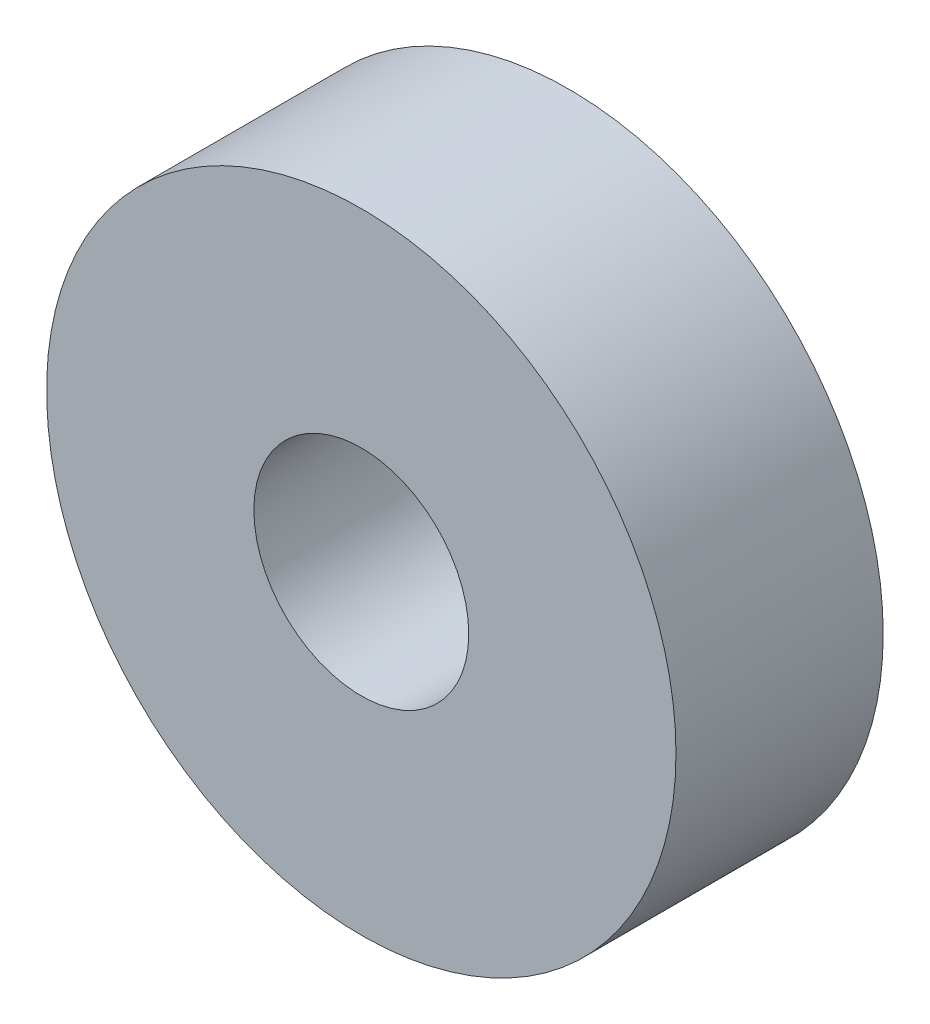
ISO-10303-21;
HEADER;
FILE_DESCRIPTION(('STEP AP214'),'2;1');
FILE_NAME('part.step','',(''),(''),'','','');
FILE_SCHEMA(('AUTOMOTIVE_DESIGN { 1 0 10303 214 1 1 1 1 }'));
ENDSEC;
DATA;
#1=APPLICATION_CONTEXT('core data for automotive mechanical design processes');
#2=APPLICATION_PROTOCOL_DEFINITION('international standard','automotive_design',2000,#1);
#3=PRODUCT_CONTEXT('',#1,'mechanical');
#4=PRODUCT('Part','Part','',(#3));
#5=PRODUCT_RELATED_PRODUCT_CATEGORY('part','',(#4));
#6=PRODUCT_DEFINITION_FORMATION('','',#4);
#7=PRODUCT_DEFINITION_CONTEXT('part definition',#1,'design');
#8=PRODUCT_DEFINITION('design','',#6,#7);
#9=PRODUCT_DEFINITION_SHAPE('','',#8);
#10=(LENGTH_UNIT() NAMED_UNIT(*) SI_UNIT(.MILLI.,.METRE.));
#11=(NAMED_UNIT(*) PLANE_ANGLE_UNIT() SI_UNIT($,.RADIAN.));
#12=(NAMED_UNIT(*) SI_UNIT($,.STERADIAN.) SOLID_ANGLE_UNIT());
#13=UNCERTAINTY_MEASURE_WITH_UNIT(LENGTH_MEASURE(1.E-05),#10,'distance_accuracy_value','');
#14=(GEOMETRIC_REPRESENTATION_CONTEXT(3) GLOBAL_UNCERTAINTY_ASSIGNED_CONTEXT((#13)) GLOBAL_UNIT_ASSIGNED_CONTEXT((#10,
#11,#12)) REPRESENTATION_CONTEXT('',''));
#15=CARTESIAN_POINT('',(0.,0.,0.));
#16=DIRECTION('',(0.,0.,1.));
#17=DIRECTION('',(1.,0.,0.));
#18=AXIS2_PLACEMENT_3D('',#15,#16,#17);
#19=CARTESIAN_POINT('',(0.,0.,-27.));
#20=DIRECTION('',(0.,0.,1.));
#21=DIRECTION('',(1.,0.,0.));
#22=AXIS2_PLACEMENT_3D('',#19,#20,#21);
#23=CYLINDRICAL_SURFACE('',#22,41.);
#24=CARTESIAN_POINT('',(0.,0.,-27.));
#25=DIRECTION('',(0.,0.,1.));
#26=DIRECTION('',(1.,0.,0.));
#27=AXIS2_PLACEMENT_3D('',#24,#25,#26);
#28=CIRCLE('',#27,41.);
#29=CARTESIAN_POINT('',(41.,0.,-27.));
#30=VERTEX_POINT('',#29);
#31=EDGE_CURVE('E10',#30,#30,#28,.T.);
#32=ORIENTED_EDGE('',*,*,#31,.T.);
#33=EDGE_LOOP('',(#32));
#34=FACE_BOUND('',#33,.T.);
#35=CARTESIAN_POINT('',(0.,0.,0.));
#36=DIRECTION('',(0.,0.,1.));
#37=DIRECTION('',(1.,0.,0.));
#38=AXIS2_PLACEMENT_3D('',#35,#36,#37);
#39=CIRCLE('',#38,41.);
#40=CARTESIAN_POINT('',(41.,0.,0.));
#41=VERTEX_POINT('',#40);
#42=EDGE_CURVE('E34',#41,#41,#39,.T.);
#43=ORIENTED_EDGE('',*,*,#42,.F.);
#44=EDGE_LOOP('',(#43));
#45=FACE_BOUND('',#44,.T.);
#46=ADVANCED_FACE('F31',(#34,#45),#23,.T.);
#47=CARTESIAN_POINT('',(0.,0.,-27.));
#48=DIRECTION('',(0.,0.,1.));
#49=DIRECTION('',(1.,0.,0.));
#50=AXIS2_PLACEMENT_3D('',#47,#48,#49);
#51=PLANE('',#50);
#52=CARTESIAN_POINT('',(0.,0.,-27.));
#53=DIRECTION('',(0.,0.,1.));
#54=DIRECTION('',(1.,0.,0.));
#55=AXIS2_PLACEMENT_3D('',#52,#53,#54);
#56=CIRCLE('',#55,14.);
#57=CARTESIAN_POINT('',(14.,0.,-27.));
#58=VERTEX_POINT('',#57);
#59=EDGE_CURVE('E41',#58,#58,#56,.T.);
#60=ORIENTED_EDGE('',*,*,#59,.T.);
#61=EDGE_LOOP('',(#60));
#62=FACE_BOUND('',#61,.T.);
#63=ORIENTED_EDGE('',*,*,#31,.F.);
#64=EDGE_LOOP('',(#63));
#65=FACE_BOUND('',#64,.T.);
#66=ADVANCED_FACE('F49',(#62,#65),#51,.F.);
#67=CARTESIAN_POINT('',(0.,0.,0.));
#68=DIRECTION('',(0.,0.,1.));
#69=DIRECTION('',(1.,0.,0.));
#70=AXIS2_PLACEMENT_3D('',#67,#68,#69);
#71=PLANE('',#70);
#72=CARTESIAN_POINT('',(0.,0.,0.));
#73=DIRECTION('',(0.,0.,1.));
#74=DIRECTION('',(1.,0.,0.));
#75=AXIS2_PLACEMENT_3D('',#72,#73,#74);
#76=CIRCLE('',#75,14.);
#77=CARTESIAN_POINT('',(14.,0.,0.));
#78=VERTEX_POINT('',#77);
#79=EDGE_CURVE('E43',#78,#78,#76,.T.);
#80=ORIENTED_EDGE('',*,*,#79,.F.);
#81=EDGE_LOOP('',(#80));
#82=FACE_BOUND('',#81,.T.);
#83=ORIENTED_EDGE('',*,*,#42,.T.);
#84=EDGE_LOOP('',(#83));
#85=FACE_BOUND('',#84,.T.);
#86=ADVANCED_FACE('F55',(#82,#85),#71,.T.);
#87=CARTESIAN_POINT('',(0.,0.,-27.));
#88=DIRECTION('',(0.,0.,1.));
#89=DIRECTION('',(1.,0.,0.));
#90=AXIS2_PLACEMENT_3D('',#87,#88,#89);
#91=CYLINDRICAL_SURFACE('',#90,14.);
#92=ORIENTED_EDGE('',*,*,#59,.F.);
#93=EDGE_LOOP('',(#92));
#94=FACE_BOUND('',#93,.T.);
#95=ORIENTED_EDGE('',*,*,#79,.T.);
#96=EDGE_LOOP('',(#95));
#97=FACE_BOUND('',#96,.T.);
#98=ADVANCED_FACE('F52',(#94,#97),#91,.F.);
#99=CLOSED_SHELL('',(#46,#66,#86,#98));
#100=MANIFOLD_SOLID_BREP('B2',#99);
#101=ADVANCED_BREP_SHAPE_REPRESENTATION('',(#18,#100),#14);
#102=SHAPE_DEFINITION_REPRESENTATION(#9,#101);
ENDSEC;
END-ISO-10303-21;
